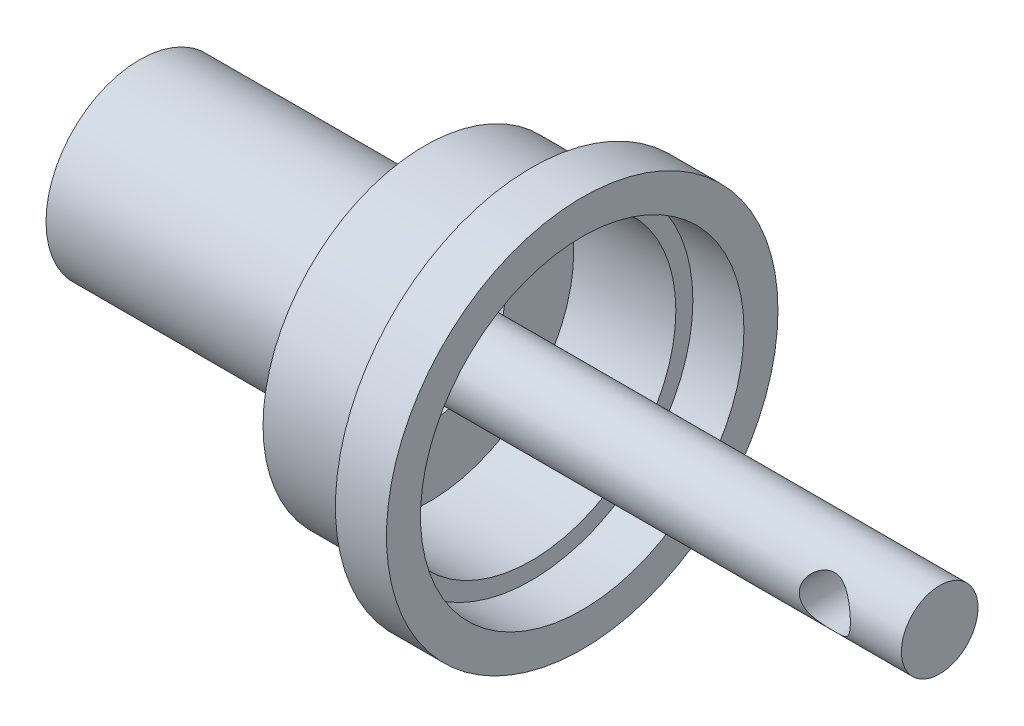
ISO-10303-21;
HEADER;
FILE_DESCRIPTION(('STEP AP214'),'2;1');
FILE_NAME('part.step','',(''),(''),'','','');
FILE_SCHEMA(('AUTOMOTIVE_DESIGN { 1 0 10303 214 1 1 1 1 }'));
ENDSEC;
DATA;
#1=APPLICATION_CONTEXT('core data for automotive mechanical design processes');
#2=APPLICATION_PROTOCOL_DEFINITION('international standard','automotive_design',2000,#1);
#3=PRODUCT_CONTEXT('',#1,'mechanical');
#4=PRODUCT('Part','Part','',(#3));
#5=PRODUCT_RELATED_PRODUCT_CATEGORY('part','',(#4));
#6=PRODUCT_DEFINITION_FORMATION('','',#4);
#7=PRODUCT_DEFINITION_CONTEXT('part definition',#1,'design');
#8=PRODUCT_DEFINITION('design','',#6,#7);
#9=PRODUCT_DEFINITION_SHAPE('','',#8);
#10=(LENGTH_UNIT() NAMED_UNIT(*) SI_UNIT(.MILLI.,.METRE.));
#11=(NAMED_UNIT(*) PLANE_ANGLE_UNIT() SI_UNIT($,.RADIAN.));
#12=(NAMED_UNIT(*) SI_UNIT($,.STERADIAN.) SOLID_ANGLE_UNIT());
#13=UNCERTAINTY_MEASURE_WITH_UNIT(LENGTH_MEASURE(1.E-05),#10,'distance_accuracy_value','');
#14=(GEOMETRIC_REPRESENTATION_CONTEXT(3) GLOBAL_UNCERTAINTY_ASSIGNED_CONTEXT((#13)) GLOBAL_UNIT_ASSIGNED_CONTEXT((#10,
#11,#12)) REPRESENTATION_CONTEXT('',''));
#15=CARTESIAN_POINT('',(0.,0.,0.));
#16=DIRECTION('',(0.,0.,1.));
#17=DIRECTION('',(1.,0.,0.));
#18=AXIS2_PLACEMENT_3D('',#15,#16,#17);
#19=CARTESIAN_POINT('',(26.,0.,0.));
#20=DIRECTION('',(1.,0.,0.));
#21=DIRECTION('',(0.,0.,-1.));
#22=AXIS2_PLACEMENT_3D('',#19,#20,#21);
#23=PLANE('',#22);
#24=CARTESIAN_POINT('',(26.,0.,0.));
#25=DIRECTION('',(1.,0.,0.));
#26=DIRECTION('',(0.,0.,-1.));
#27=AXIS2_PLACEMENT_3D('',#24,#25,#26);
#28=CIRCLE('',#27,11.5);
#29=CARTESIAN_POINT('',(26.,0.,-11.5));
#30=VERTEX_POINT('',#29);
#31=EDGE_CURVE('E12',#30,#30,#28,.T.);
#32=ORIENTED_EDGE('',*,*,#31,.T.);
#33=EDGE_LOOP('',(#32));
#34=FACE_BOUND('',#33,.T.);
#35=CARTESIAN_POINT('',(26.,0.,0.));
#36=DIRECTION('',(1.,0.,0.));
#37=DIRECTION('',(0.,0.,-1.));
#38=AXIS2_PLACEMENT_3D('',#35,#36,#37);
#39=CIRCLE('',#38,9.5);
#40=CARTESIAN_POINT('',(26.,0.,-9.5));
#41=VERTEX_POINT('',#40);
#42=EDGE_CURVE('E56',#41,#41,#39,.T.);
#43=ORIENTED_EDGE('',*,*,#42,.F.);
#44=EDGE_LOOP('',(#43));
#45=FACE_BOUND('',#44,.T.);
#46=ADVANCED_FACE('F45',(#34,#45),#23,.T.);
#47=CARTESIAN_POINT('',(23.,0.,0.));
#48=DIRECTION('',(1.,0.,0.));
#49=DIRECTION('',(0.,0.,-1.));
#50=AXIS2_PLACEMENT_3D('',#47,#48,#49);
#51=PLANE('',#50);
#52=CARTESIAN_POINT('',(23.,0.,0.));
#53=DIRECTION('',(1.,0.,0.));
#54=DIRECTION('',(0.,0.,-1.));
#55=AXIS2_PLACEMENT_3D('',#52,#53,#54);
#56=CIRCLE('',#55,11.5);
#57=CARTESIAN_POINT('',(23.,0.,-11.5));
#58=VERTEX_POINT('',#57);
#59=EDGE_CURVE('E49',#58,#58,#56,.T.);
#60=ORIENTED_EDGE('',*,*,#59,.F.);
#61=EDGE_LOOP('',(#60));
#62=FACE_BOUND('',#61,.T.);
#63=CARTESIAN_POINT('',(23.,0.,0.));
#64=DIRECTION('',(1.,0.,0.));
#65=DIRECTION('',(0.,0.,-1.));
#66=AXIS2_PLACEMENT_3D('',#63,#64,#65);
#67=CIRCLE('',#66,9.5);
#68=CARTESIAN_POINT('',(23.,0.,-9.5));
#69=VERTEX_POINT('',#68);
#70=EDGE_CURVE('E58',#69,#69,#67,.T.);
#71=ORIENTED_EDGE('',*,*,#70,.T.);
#72=EDGE_LOOP('',(#71));
#73=FACE_BOUND('',#72,.T.);
#74=ADVANCED_FACE('F68',(#62,#73),#51,.F.);
#75=CARTESIAN_POINT('',(26.,0.,0.));
#76=DIRECTION('',(-1.,0.,0.));
#77=DIRECTION('',(0.,0.,1.));
#78=AXIS2_PLACEMENT_3D('',#75,#76,#77);
#79=CYLINDRICAL_SURFACE('',#78,11.5);
#80=ORIENTED_EDGE('',*,*,#31,.F.);
#81=EDGE_LOOP('',(#80));
#82=FACE_BOUND('',#81,.T.);
#83=ORIENTED_EDGE('',*,*,#59,.T.);
#84=EDGE_LOOP('',(#83));
#85=FACE_BOUND('',#84,.T.);
#86=ADVANCED_FACE('F47',(#82,#85),#79,.T.);
#87=CARTESIAN_POINT('',(26.,0.,0.));
#88=DIRECTION('',(-1.,0.,0.));
#89=DIRECTION('',(0.,0.,1.));
#90=AXIS2_PLACEMENT_3D('',#87,#88,#89);
#91=CYLINDRICAL_SURFACE('',#90,9.5);
#92=ORIENTED_EDGE('',*,*,#42,.T.);
#93=EDGE_LOOP('',(#92));
#94=FACE_BOUND('',#93,.T.);
#95=ORIENTED_EDGE('',*,*,#70,.F.);
#96=EDGE_LOOP('',(#95));
#97=FACE_BOUND('',#96,.T.);
#98=ADVANCED_FACE('F64',(#94,#97),#91,.F.);
#99=CLOSED_SHELL('',(#46,#74,#86,#98));
#100=MANIFOLD_SOLID_BREP('B2',#99);
#101=CARTESIAN_POINT('',(17.,0.,0.));
#102=DIRECTION('',(-1.,0.,0.));
#103=DIRECTION('',(0.,0.,1.));
#104=AXIS2_PLACEMENT_3D('',#101,#102,#103);
#105=CYLINDRICAL_SURFACE('',#104,4.5);
#106=CARTESIAN_POINT('',(17.,0.,0.));
#107=DIRECTION('',(1.,0.,0.));
#108=DIRECTION('',(0.,0.,-1.));
#109=AXIS2_PLACEMENT_3D('',#106,#107,#108);
#110=CIRCLE('',#109,4.5);
#111=CARTESIAN_POINT('',(17.,0.,-4.5));
#112=VERTEX_POINT('',#111);
#113=EDGE_CURVE('E133',#112,#112,#110,.T.);
#114=ORIENTED_EDGE('',*,*,#113,.T.);
#115=EDGE_LOOP('',(#114));
#116=FACE_BOUND('',#115,.T.);
#117=CARTESIAN_POINT('',(5.,0.,0.));
#118=DIRECTION('',(1.,0.,0.));
#119=DIRECTION('',(0.,0.,-1.));
#120=AXIS2_PLACEMENT_3D('',#117,#118,#119);
#121=CIRCLE('',#120,4.5);
#122=CARTESIAN_POINT('',(5.,0.,-4.5));
#123=VERTEX_POINT('',#122);
#124=EDGE_CURVE('E120',#123,#123,#121,.F.);
#125=ORIENTED_EDGE('',*,*,#124,.T.);
#126=EDGE_LOOP('',(#125));
#127=FACE_BOUND('',#126,.T.);
#128=ADVANCED_FACE('F107',(#116,#127),#105,.F.);
#129=CARTESIAN_POINT('',(5.,0.,0.));
#130=DIRECTION('',(1.,0.,0.));
#131=DIRECTION('',(0.,0.,-1.));
#132=AXIS2_PLACEMENT_3D('',#129,#130,#131);
#133=PLANE('',#132);
#134=CARTESIAN_POINT('',(5.,0.,0.));
#135=DIRECTION('',(1.,0.,0.));
#136=DIRECTION('',(0.,0.,-1.));
#137=AXIS2_PLACEMENT_3D('',#134,#135,#136);
#138=CIRCLE('',#137,2.25);
#139=CARTESIAN_POINT('',(5.,0.,-2.25));
#140=VERTEX_POINT('',#139);
#141=EDGE_CURVE('E192',#140,#140,#138,.T.);
#142=ORIENTED_EDGE('',*,*,#141,.F.);
#143=EDGE_LOOP('',(#142));
#144=FACE_BOUND('',#143,.T.);
#145=ORIENTED_EDGE('',*,*,#124,.F.);
#146=EDGE_LOOP('',(#145));
#147=FACE_BOUND('',#146,.T.);
#148=ADVANCED_FACE('F167',(#144,#147),#133,.T.);
#149=CARTESIAN_POINT('',(47.,0.,0.));
#150=DIRECTION('',(-1.,0.,0.));
#151=DIRECTION('',(0.,0.,1.));
#152=AXIS2_PLACEMENT_3D('',#149,#150,#151);
#153=CYLINDRICAL_SURFACE('',#152,2.25);
#154=ORIENTED_EDGE('',*,*,#141,.T.);
#155=EDGE_LOOP('',(#154));
#156=FACE_BOUND('',#155,.T.);
#157=CARTESIAN_POINT('',(44.,0.,2.25));
#158=CARTESIAN_POINT('',(44.0000004122244,-0.0753635375010582,2.2500003123363));
#159=CARTESIAN_POINT('',(43.9942895225334,-0.150726815349676,2.24618102065041));
#160=CARTESIAN_POINT('',(43.9718023519208,-0.299049793523761,2.23128489317856));
#161=CARTESIAN_POINT('',(43.9550208176575,-0.372008335466256,2.22020461185926));
#162=CARTESIAN_POINT('',(43.9114192120064,-0.513159230890688,2.19187861803531));
#163=CARTESIAN_POINT('',(43.8846461449941,-0.581372154493168,2.17466179119986));
#164=CARTESIAN_POINT('',(43.8222024775464,-0.712061468247949,2.1354460340808));
#165=CARTESIAN_POINT('',(43.7865305852746,-0.774537023707255,2.11344640954132));
#166=CARTESIAN_POINT('',(43.7040072969744,-0.897963525577585,2.06420497027379));
#167=CARTESIAN_POINT('',(43.6564641044428,-0.95833522909551,2.03667673184489));
#168=CARTESIAN_POINT('',(43.5532024635062,-1.07079603351956,1.97986734812599));
#169=CARTESIAN_POINT('',(43.4974723026217,-1.12287304157916,1.95058372767623));
#170=CARTESIAN_POINT('',(43.3692107242905,-1.22566723309122,1.88796198509096));
#171=CARTESIAN_POINT('',(43.2954157600974,-1.27487389772064,1.85471300953349));
#172=CARTESIAN_POINT('',(43.1387274667651,-1.36012767760631,1.79313110514612));
#173=CARTESIAN_POINT('',(43.0558501988279,-1.39619755069875,1.7647897196599));
#174=CARTESIAN_POINT('',(42.9074665299338,-1.44505526258581,1.72482199981103));
#175=CARTESIAN_POINT('',(42.8438536603446,-1.46155835427013,1.71073220919326));
#176=CARTESIAN_POINT('',(42.7139416214437,-1.48612963338915,1.68943477244678));
#177=CARTESIAN_POINT('',(42.6476472884552,-1.4942123598895,1.68221526558019));
#178=CARTESIAN_POINT('',(42.5138939158579,-1.50143523105944,1.67577454206125));
#179=CARTESIAN_POINT('',(42.4464312324116,-1.50053882188231,1.67658601919217));
#180=CARTESIAN_POINT('',(42.3127737698743,-1.48978185999929,1.68614831612228));
#181=CARTESIAN_POINT('',(42.2465801134755,-1.47991371284968,1.69490586213888));
#182=CARTESIAN_POINT('',(42.1201497115718,-1.45248745663307,1.71845389493686));
#183=CARTESIAN_POINT('',(42.0597789980577,-1.4352878361075,1.7329611624773));
#184=CARTESIAN_POINT('',(41.9427322317564,-1.39402588936425,1.76632217195768));
#185=CARTESIAN_POINT('',(41.886057402277,-1.36996130492153,1.78517734374582));
#186=CARTESIAN_POINT('',(41.7657309535383,-1.31005364054748,1.82973147303318));
#187=CARTESIAN_POINT('',(41.7030050748589,-1.27281039246576,1.85604238386761));
#188=CARTESIAN_POINT('',(41.5839624537621,-1.19001720350479,1.91018653383725));
#189=CARTESIAN_POINT('',(41.5276537567443,-1.1444570175605,1.9380216205642));
#190=CARTESIAN_POINT('',(41.4105930907166,-1.03485873983956,1.99907507793144));
#191=CARTESIAN_POINT('',(41.3514994634664,-0.968954537106741,2.03216058532537));
#192=CARTESIAN_POINT('',(41.2451026291176,-0.826505999330705,2.09413575506785));
#193=CARTESIAN_POINT('',(41.1977883909484,-0.749971724512736,2.12302933237928));
#194=CARTESIAN_POINT('',(41.1248917110287,-0.60364337031839,2.16859053066249));
#195=CARTESIAN_POINT('',(41.0968674774947,-0.53546823252785,2.18654445873747));
#196=CARTESIAN_POINT('',(41.0509213057821,-0.394527032952668,2.21630789273282));
#197=CARTESIAN_POINT('',(41.0329908296511,-0.321764909251513,2.22812259095767));
#198=CARTESIAN_POINT('',(41.0081291260712,-0.173239089878911,2.24456911617496));
#199=CARTESIAN_POINT('',(41.0012454042962,-0.0974638589505289,2.24916991845861));
#200=CARTESIAN_POINT('',(40.9990646835784,0.054331139541946,2.25062336223889));
#201=CARTESIAN_POINT('',(41.0037668746334,0.130350889639962,2.24747654539233));
#202=CARTESIAN_POINT('',(41.0237180416715,0.274841787903212,2.23424692068197));
#203=CARTESIAN_POINT('',(41.0382029733164,0.343468083509414,2.22466684792667));
#204=CARTESIAN_POINT('',(41.0761967645097,0.47708729432056,2.19988836963629));
#205=CARTESIAN_POINT('',(41.0997070631962,0.542079628178361,2.18468906810242));
#206=CARTESIAN_POINT('',(41.1564892227837,0.670998562849511,2.14872264396867));
#207=CARTESIAN_POINT('',(41.1902661155614,0.734622138473577,2.12767402601838));
#208=CARTESIAN_POINT('',(41.2658249674597,0.855512267967981,2.08201391708632));
#209=CARTESIAN_POINT('',(41.3076118703991,0.912774861150694,2.05740022802955));
#210=CARTESIAN_POINT('',(41.4054559011181,1.02889084111744,2.00215909990072));
#211=CARTESIAN_POINT('',(41.4627246950563,1.08656390677175,1.97119617600123));
#212=CARTESIAN_POINT('',(41.5858335724679,1.19200476052088,1.90928379814467));
#213=CARTESIAN_POINT('',(41.6516795293306,1.23976570242923,1.87833436813383));
#214=CARTESIAN_POINT('',(41.7853568095761,1.32093582411986,1.82204759227934));
#215=CARTESIAN_POINT('',(41.8525490250967,1.35521727093963,1.79645697769275));
#216=CARTESIAN_POINT('',(41.9929044893327,1.41372160305199,1.75079230699615));
#217=CARTESIAN_POINT('',(42.0660567037285,1.43796259261643,1.73070834397366));
#218=CARTESIAN_POINT('',(42.2034233653966,1.47176882599005,1.70199906136974));
#219=CARTESIAN_POINT('',(42.266878857407,1.48318948174669,1.69196248515942));
#220=CARTESIAN_POINT('',(42.3954299609888,1.4977440444253,1.67909599828798));
#221=CARTESIAN_POINT('',(42.4605237133546,1.50088695213988,1.67625826010862));
#222=CARTESIAN_POINT('',(42.5904822925428,1.4986794148595,1.67823150862486));
#223=CARTESIAN_POINT('',(42.6553469610303,1.49332394075838,1.68304702430597));
#224=CARTESIAN_POINT('',(42.7830076463991,1.47447747918559,1.69957839302618));
#225=CARTESIAN_POINT('',(42.8458007853683,1.46097563796193,1.71130345145711));
#226=CARTESIAN_POINT('',(42.9842833898609,1.4219477674312,1.74395132928601));
#227=CARTESIAN_POINT('',(43.0589507847075,1.39417640348073,1.76649250181237));
#228=CARTESIAN_POINT('',(43.2016151257882,1.32813394677165,1.81666620840982));
#229=CARTESIAN_POINT('',(43.2696025234938,1.28984811255944,1.84430587265025));
#230=CARTESIAN_POINT('',(43.3994614153522,1.20298710416364,1.9021288993284));
#231=CARTESIAN_POINT('',(43.4611990590673,1.15423732420515,1.9323494054421));
#232=CARTESIAN_POINT('',(43.5764918586935,1.0475382602332,1.99221226153383));
#233=CARTESIAN_POINT('',(43.6300444977719,0.989586157693103,2.02185443124298));
#234=CARTESIAN_POINT('',(43.7350340782318,0.856092997327292,2.08223663973062));
#235=CARTESIAN_POINT('',(43.7850639801337,0.779221252166795,2.11252354087494));
#236=CARTESIAN_POINT('',(43.870934957499,0.615651416828395,2.16583249405621));
#237=CARTESIAN_POINT('',(43.906798330118,0.52896904683685,2.18886595083942));
#238=CARTESIAN_POINT('',(43.9558659336228,0.368576302376793,2.22076233627672));
#239=CARTESIAN_POINT('',(43.972333279324,0.296259243943428,2.23163610276701));
#240=CARTESIAN_POINT('',(43.9943960244036,0.149293509017953,2.2462521010639));
#241=CARTESIAN_POINT('',(43.999999591697,0.0746466271410026,2.24999969063486));
#242=CARTESIAN_POINT('',(44.,0.,2.25));
#243=B_SPLINE_CURVE_WITH_KNOTS('',3,(#157,#158,#159,#160,#161,#162,#163,#164,#165,#166,#167,
#168,#169,#170,#171,#172,#173,#174,#175,#176,#177,#178,#179,#180,#181,#182,#183,#184,#185,#186,
#187,#188,#189,#190,#191,#192,#193,#194,#195,#196,#197,#198,#199,#200,#201,#202,#203,#204,#205,
#206,#207,#208,#209,#210,#211,#212,#213,#214,#215,#216,#217,#218,#219,#220,#221,#222,#223,#224,
#225,#226,#227,#228,#229,#230,#231,#232,#233,#234,#235,#236,#237,#238,#239,#240,#241,#242),
.UNSPECIFIED.,.T.,.F.,(4,2,2,2,2,2,2,2,2,2,2,2,2,2,2,2,2,2,2,2,2,2,2,2,2,2,2,2,2,2,2,2,2,2,2,2,
2,2,2,2,2,2,4),(0.,0.225789919879049,0.451687060761517,0.676534614892679,0.901414829005404,
1.14537771750418,1.38969308703239,1.67255012471987,1.9549147908408,2.15575270257023,
2.35624325884358,2.55755033801536,2.75902797947516,2.95161646648519,3.14426837853811,
3.37610680994697,3.60823277833821,3.89039215871342,4.172286302248,4.39893065771347,
4.62538301355888,4.85280662469467,5.0802143364884,5.29164813593133,5.50311566352482,
5.72739260120916,5.95180841207682,6.21171132104748,6.47179314880597,6.70987451477136,
6.9475246997932,7.14243036010879,7.33712400248597,7.5319329021219,7.72700192888079,
7.97404956526924,8.22144535032245,8.47334433902143,8.72532062976394,9.01346513667902,
9.301154299194,9.52496468523838,9.74860673443454),.UNSPECIFIED.);
#244=CARTESIAN_POINT('',(44.,0.,2.25));
#245=VERTEX_POINT('',#244);
#246=EDGE_CURVE('E111',#245,#245,#243,.T.);
#247=ORIENTED_EDGE('',*,*,#246,.T.);
#248=EDGE_LOOP('',(#247));
#249=FACE_BOUND('',#248,.T.);
#250=CARTESIAN_POINT('',(44.,0.,-2.25));
#251=CARTESIAN_POINT('',(44.0000004122244,0.0753635375010587,-2.2500003123363));
#252=CARTESIAN_POINT('',(43.9942895225334,0.150726815349677,-2.24618102065041));
#253=CARTESIAN_POINT('',(43.9718023519208,0.299049793523762,-2.23128489317856));
#254=CARTESIAN_POINT('',(43.9550208176575,0.372008335466256,-2.22020461185926));
#255=CARTESIAN_POINT('',(43.9114192120064,0.513159230890688,-2.19187861803531));
#256=CARTESIAN_POINT('',(43.8846461449941,0.581372154493167,-2.17466179119986));
#257=CARTESIAN_POINT('',(43.8222024775464,0.712061468247947,-2.1354460340808));
#258=CARTESIAN_POINT('',(43.7865305852746,0.774537023707255,-2.11344640954132));
#259=CARTESIAN_POINT('',(43.7040072969744,0.897963525577586,-2.06420497027378));
#260=CARTESIAN_POINT('',(43.6564641044428,0.958335229095511,-2.03667673184489));
#261=CARTESIAN_POINT('',(43.5532024635062,1.07079603351956,-1.97986734812599));
#262=CARTESIAN_POINT('',(43.4974723026217,1.12287304157916,-1.95058372767623));
#263=CARTESIAN_POINT('',(43.3692107242905,1.22566723309122,-1.88796198509096));
#264=CARTESIAN_POINT('',(43.2954157600974,1.27487389772063,-1.85471300953349));
#265=CARTESIAN_POINT('',(43.1387274667651,1.36012767760631,-1.79313110514612));
#266=CARTESIAN_POINT('',(43.0558501988279,1.39619755069875,-1.7647897196599));
#267=CARTESIAN_POINT('',(42.9074665299338,1.44505526258581,-1.72482199981103));
#268=CARTESIAN_POINT('',(42.8438536603446,1.46155835427013,-1.71073220919326));
#269=CARTESIAN_POINT('',(42.7139416214437,1.48612963338916,-1.68943477244678));
#270=CARTESIAN_POINT('',(42.6476472884552,1.4942123598895,-1.68221526558019));
#271=CARTESIAN_POINT('',(42.5138939158579,1.50143523105944,-1.67577454206125));
#272=CARTESIAN_POINT('',(42.4464312324116,1.50053882188231,-1.67658601919217));
#273=CARTESIAN_POINT('',(42.3127737698743,1.48978185999929,-1.68614831612228));
#274=CARTESIAN_POINT('',(42.2465801134755,1.47991371284968,-1.69490586213887));
#275=CARTESIAN_POINT('',(42.1201497115718,1.45248745663307,-1.71845389493686));
#276=CARTESIAN_POINT('',(42.0597789980577,1.43528783610751,-1.73296116247729));
#277=CARTESIAN_POINT('',(41.9427322317564,1.39402588936425,-1.76632217195768));
#278=CARTESIAN_POINT('',(41.886057402277,1.36996130492153,-1.78517734374582));
#279=CARTESIAN_POINT('',(41.7657309535383,1.31005364054748,-1.82973147303318));
#280=CARTESIAN_POINT('',(41.7030050748589,1.27281039246576,-1.85604238386761));
#281=CARTESIAN_POINT('',(41.5839624537621,1.19001720350479,-1.91018653383725));
#282=CARTESIAN_POINT('',(41.5276537567443,1.1444570175605,-1.9380216205642));
#283=CARTESIAN_POINT('',(41.4105930907166,1.03485873983956,-1.99907507793143));
#284=CARTESIAN_POINT('',(41.3514994634664,0.968954537106742,-2.03216058532537));
#285=CARTESIAN_POINT('',(41.2451026291176,0.826505999330706,-2.09413575506785));
#286=CARTESIAN_POINT('',(41.1977883909484,0.749971724512737,-2.12302933237928));
#287=CARTESIAN_POINT('',(41.1248917110287,0.603643370318391,-2.16859053066249));
#288=CARTESIAN_POINT('',(41.0968674774947,0.535468232527851,-2.18654445873747));
#289=CARTESIAN_POINT('',(41.0509213057821,0.394527032952669,-2.21630789273282));
#290=CARTESIAN_POINT('',(41.0329908296511,0.321764909251514,-2.22812259095767));
#291=CARTESIAN_POINT('',(41.0081291260712,0.173239089878912,-2.24456911617496));
#292=CARTESIAN_POINT('',(41.0012454042962,0.0974638589505304,-2.24916991845861));
#293=CARTESIAN_POINT('',(40.9990646835784,-0.0543311395419446,-2.25062336223889));
#294=CARTESIAN_POINT('',(41.0037668746334,-0.130350889639961,-2.24747654539233));
#295=CARTESIAN_POINT('',(41.0237180416715,-0.27484178790321,-2.23424692068197));
#296=CARTESIAN_POINT('',(41.0382029733164,-0.343468083509413,-2.22466684792667));
#297=CARTESIAN_POINT('',(41.0761967645097,-0.477087294320558,-2.19988836963629));
#298=CARTESIAN_POINT('',(41.0997070631962,-0.54207962817836,-2.18468906810242));
#299=CARTESIAN_POINT('',(41.1564892227837,-0.67099856284951,-2.14872264396867));
#300=CARTESIAN_POINT('',(41.1902661155614,-0.734622138473576,-2.12767402601838));
#301=CARTESIAN_POINT('',(41.2658249674597,-0.85551226796798,-2.08201391708632));
#302=CARTESIAN_POINT('',(41.3076118703991,-0.912774861150693,-2.05740022802955));
#303=CARTESIAN_POINT('',(41.4054559011181,-1.02889084111744,-2.00215909990072));
#304=CARTESIAN_POINT('',(41.4627246950563,-1.08656390677175,-1.97119617600123));
#305=CARTESIAN_POINT('',(41.5858335724679,-1.19200476052088,-1.90928379814468));
#306=CARTESIAN_POINT('',(41.6516795293306,-1.23976570242923,-1.87833436813383));
#307=CARTESIAN_POINT('',(41.7853568095761,-1.32093582411986,-1.82204759227934));
#308=CARTESIAN_POINT('',(41.8525490250967,-1.35521727093963,-1.79645697769275));
#309=CARTESIAN_POINT('',(41.9929044893327,-1.41372160305199,-1.75079230699615));
#310=CARTESIAN_POINT('',(42.0660567037285,-1.43796259261642,-1.73070834397366));
#311=CARTESIAN_POINT('',(42.2034233653966,-1.47176882599005,-1.70199906136974));
#312=CARTESIAN_POINT('',(42.266878857407,-1.48318948174669,-1.69196248515942));
#313=CARTESIAN_POINT('',(42.3954299609888,-1.4977440444253,-1.67909599828798));
#314=CARTESIAN_POINT('',(42.4605237133546,-1.50088695213988,-1.67625826010862));
#315=CARTESIAN_POINT('',(42.5904822925428,-1.4986794148595,-1.67823150862486));
#316=CARTESIAN_POINT('',(42.6553469610303,-1.49332394075838,-1.68304702430597));
#317=CARTESIAN_POINT('',(42.7830076463991,-1.4744774791856,-1.69957839302618));
#318=CARTESIAN_POINT('',(42.8458007853683,-1.46097563796193,-1.71130345145711));
#319=CARTESIAN_POINT('',(42.9842833898609,-1.4219477674312,-1.743951329286));
#320=CARTESIAN_POINT('',(43.0589507847075,-1.39417640348073,-1.76649250181237));
#321=CARTESIAN_POINT('',(43.2016151257882,-1.32813394677165,-1.81666620840982));
#322=CARTESIAN_POINT('',(43.2696025234938,-1.28984811255944,-1.84430587265025));
#323=CARTESIAN_POINT('',(43.3994614153522,-1.20298710416364,-1.90212889932839));
#324=CARTESIAN_POINT('',(43.4611990590673,-1.15423732420515,-1.9323494054421));
#325=CARTESIAN_POINT('',(43.5764918586935,-1.04753826023321,-1.99221226153383));
#326=CARTESIAN_POINT('',(43.6300444977719,-0.989586157693111,-2.02185443124297));
#327=CARTESIAN_POINT('',(43.7350340782318,-0.8560929973273,-2.08223663973062));
#328=CARTESIAN_POINT('',(43.7850639801337,-0.779221252166802,-2.11252354087494));
#329=CARTESIAN_POINT('',(43.870934957499,-0.615651416828405,-2.16583249405621));
#330=CARTESIAN_POINT('',(43.906798330118,-0.528969046836862,-2.18886595083941));
#331=CARTESIAN_POINT('',(43.9558659336228,-0.368576302376806,-2.22076233627672));
#332=CARTESIAN_POINT('',(43.972333279324,-0.296259243943438,-2.23163610276701));
#333=CARTESIAN_POINT('',(43.9943960244036,-0.149293509017957,-2.2462521010639));
#334=CARTESIAN_POINT('',(43.999999591697,-0.0746466271410046,-2.24999969063486));
#335=CARTESIAN_POINT('',(44.,0.,-2.25));
#336=B_SPLINE_CURVE_WITH_KNOTS('',3,(#250,#251,#252,#253,#254,#255,#256,#257,#258,#259,#260,
#261,#262,#263,#264,#265,#266,#267,#268,#269,#270,#271,#272,#273,#274,#275,#276,#277,#278,#279,
#280,#281,#282,#283,#284,#285,#286,#287,#288,#289,#290,#291,#292,#293,#294,#295,#296,#297,#298,
#299,#300,#301,#302,#303,#304,#305,#306,#307,#308,#309,#310,#311,#312,#313,#314,#315,#316,#317,
#318,#319,#320,#321,#322,#323,#324,#325,#326,#327,#328,#329,#330,#331,#332,#333,#334,#335),
.UNSPECIFIED.,.T.,.F.,(4,2,2,2,2,2,2,2,2,2,2,2,2,2,2,2,2,2,2,2,2,2,2,2,2,2,2,2,2,2,2,2,2,2,2,2,
2,2,2,2,2,2,4),(0.,0.225789919879049,0.451687060761517,0.676534614892677,0.901414829005404,
1.14537771750418,1.38969308703239,1.67255012471986,1.9549147908408,2.15575270257023,
2.35624325884358,2.55755033801536,2.75902797947516,2.95161646648519,3.14426837853811,
3.37610680994697,3.60823277833821,3.89039215871342,4.172286302248,4.39893065771347,
4.62538301355888,4.85280662469467,5.0802143364884,5.29164813593133,5.50311566352481,
5.72739260120916,5.95180841207682,6.21171132104748,6.47179314880597,6.70987451477136,
6.9475246997932,7.14243036010879,7.33712400248597,7.53193290212188,7.72700192888078,
7.97404956526923,8.22144535032243,8.47334433902141,8.72532062976392,9.013465136679,
9.30115429919398,9.52496468523837,9.74860673443454),.UNSPECIFIED.);
#337=CARTESIAN_POINT('',(44.,0.,-2.25));
#338=VERTEX_POINT('',#337);
#339=EDGE_CURVE('E128',#338,#338,#336,.T.);
#340=ORIENTED_EDGE('',*,*,#339,.T.);
#341=EDGE_LOOP('',(#340));
#342=FACE_BOUND('',#341,.T.);
#343=CARTESIAN_POINT('',(47.,0.,0.));
#344=DIRECTION('',(1.,0.,0.));
#345=DIRECTION('',(0.,0.,-1.));
#346=AXIS2_PLACEMENT_3D('',#343,#344,#345);
#347=CIRCLE('',#346,2.25);
#348=CARTESIAN_POINT('',(47.,0.,-2.25));
#349=VERTEX_POINT('',#348);
#350=EDGE_CURVE('E191',#349,#349,#347,.T.);
#351=ORIENTED_EDGE('',*,*,#350,.F.);
#352=EDGE_LOOP('',(#351));
#353=FACE_BOUND('',#352,.T.);
#354=ADVANCED_FACE('F134',(#156,#249,#342,#353),#153,.T.);
#355=CARTESIAN_POINT('',(47.,0.,0.));
#356=DIRECTION('',(1.,0.,0.));
#357=DIRECTION('',(0.,0.,-1.));
#358=AXIS2_PLACEMENT_3D('',#355,#356,#357);
#359=PLANE('',#358);
#360=ORIENTED_EDGE('',*,*,#350,.T.);
#361=EDGE_LOOP('',(#360));
#362=FACE_BOUND('',#361,.T.);
#363=ADVANCED_FACE('F142',(#362),#359,.T.);
#364=CARTESIAN_POINT('',(42.5,0.,-11.5));
#365=DIRECTION('',(0.,0.,1.));
#366=DIRECTION('',(1.,0.,0.));
#367=AXIS2_PLACEMENT_3D('',#364,#365,#366);
#368=CYLINDRICAL_SURFACE('',#367,1.5);
#369=ORIENTED_EDGE('',*,*,#339,.F.);
#370=EDGE_LOOP('',(#369));
#371=FACE_BOUND('',#370,.T.);
#372=ORIENTED_EDGE('',*,*,#246,.F.);
#373=EDGE_LOOP('',(#372));
#374=FACE_BOUND('',#373,.T.);
#375=ADVANCED_FACE('F138',(#371,#374),#368,.F.);
#376=CARTESIAN_POINT('',(5.,0.,0.));
#377=DIRECTION('',(-1.,0.,0.));
#378=DIRECTION('',(0.,0.,1.));
#379=AXIS2_PLACEMENT_3D('',#376,#377,#378);
#380=CYLINDRICAL_SURFACE('',#379,5.5);
#381=CARTESIAN_POINT('',(16.75,0.,0.));
#382=DIRECTION('',(-1.,0.,0.));
#383=DIRECTION('',(0.,0.,1.));
#384=AXIS2_PLACEMENT_3D('',#381,#382,#383);
#385=CIRCLE('',#384,5.5);
#386=CARTESIAN_POINT('',(16.75,0.,5.5));
#387=VERTEX_POINT('',#386);
#388=EDGE_CURVE('E196',#387,#387,#385,.T.);
#389=ORIENTED_EDGE('',*,*,#388,.T.);
#390=EDGE_LOOP('',(#389));
#391=FACE_BOUND('',#390,.T.);
#392=CARTESIAN_POINT('',(0.,0.,0.));
#393=DIRECTION('',(1.,0.,0.));
#394=DIRECTION('',(0.,0.,-1.));
#395=AXIS2_PLACEMENT_3D('',#392,#393,#394);
#396=CIRCLE('',#395,5.5);
#397=CARTESIAN_POINT('',(0.,0.,-5.5));
#398=VERTEX_POINT('',#397);
#399=EDGE_CURVE('E125',#398,#398,#396,.T.);
#400=ORIENTED_EDGE('',*,*,#399,.T.);
#401=EDGE_LOOP('',(#400));
#402=FACE_BOUND('',#401,.T.);
#403=ADVANCED_FACE('F109',(#391,#402),#380,.T.);
#404=CARTESIAN_POINT('',(0.,0.,0.));
#405=DIRECTION('',(1.,0.,0.));
#406=DIRECTION('',(0.,0.,-1.));
#407=AXIS2_PLACEMENT_3D('',#404,#405,#406);
#408=PLANE('',#407);
#409=ORIENTED_EDGE('',*,*,#399,.F.);
#410=EDGE_LOOP('',(#409));
#411=FACE_BOUND('',#410,.T.);
#412=ADVANCED_FACE('F160',(#411),#408,.F.);
#413=CARTESIAN_POINT('',(16.75,0.,0.));
#414=DIRECTION('',(1.,0.,0.));
#415=DIRECTION('',(0.,0.,-1.));
#416=AXIS2_PLACEMENT_3D('',#413,#414,#415);
#417=CYLINDRICAL_SURFACE('',#416,9.5);
#418=CARTESIAN_POINT('',(16.75,0.,0.));
#419=DIRECTION('',(-1.,0.,0.));
#420=DIRECTION('',(0.,0.,1.));
#421=AXIS2_PLACEMENT_3D('',#418,#419,#420);
#422=CIRCLE('',#421,9.5);
#423=CARTESIAN_POINT('',(16.75,0.,9.5));
#424=VERTEX_POINT('',#423);
#425=EDGE_CURVE('E200',#424,#424,#422,.T.);
#426=ORIENTED_EDGE('',*,*,#425,.F.);
#427=EDGE_LOOP('',(#426));
#428=FACE_BOUND('',#427,.T.);
#429=CARTESIAN_POINT('',(23.,0.,0.));
#430=DIRECTION('',(1.,0.,0.));
#431=DIRECTION('',(0.,0.,-1.));
#432=AXIS2_PLACEMENT_3D('',#429,#430,#431);
#433=CIRCLE('',#432,9.5);
#434=CARTESIAN_POINT('',(23.,0.,-9.5));
#435=VERTEX_POINT('',#434);
#436=EDGE_CURVE('E203',#435,#435,#433,.T.);
#437=ORIENTED_EDGE('',*,*,#436,.F.);
#438=EDGE_LOOP('',(#437));
#439=FACE_BOUND('',#438,.T.);
#440=ADVANCED_FACE('F157',(#428,#439),#417,.T.);
#441=CARTESIAN_POINT('',(16.75,0.,0.));
#442=DIRECTION('',(-1.,0.,0.));
#443=DIRECTION('',(0.,0.,1.));
#444=AXIS2_PLACEMENT_3D('',#441,#442,#443);
#445=PLANE('',#444);
#446=ORIENTED_EDGE('',*,*,#388,.F.);
#447=EDGE_LOOP('',(#446));
#448=FACE_BOUND('',#447,.T.);
#449=ORIENTED_EDGE('',*,*,#425,.T.);
#450=EDGE_LOOP('',(#449));
#451=FACE_BOUND('',#450,.T.);
#452=ADVANCED_FACE('F153',(#448,#451),#445,.T.);
#453=CARTESIAN_POINT('',(23.,0.,0.));
#454=DIRECTION('',(1.,0.,0.));
#455=DIRECTION('',(0.,0.,-1.));
#456=AXIS2_PLACEMENT_3D('',#453,#454,#455);
#457=PLANE('',#456);
#458=ORIENTED_EDGE('',*,*,#436,.T.);
#459=EDGE_LOOP('',(#458));
#460=FACE_BOUND('',#459,.T.);
#461=CARTESIAN_POINT('',(23.,0.,0.));
#462=DIRECTION('',(1.,0.,0.));
#463=DIRECTION('',(0.,0.,-1.));
#464=AXIS2_PLACEMENT_3D('',#461,#462,#463);
#465=CIRCLE('',#464,8.5);
#466=CARTESIAN_POINT('',(23.,0.,-8.5));
#467=VERTEX_POINT('',#466);
#468=EDGE_CURVE('E206',#467,#467,#465,.T.);
#469=ORIENTED_EDGE('',*,*,#468,.F.);
#470=EDGE_LOOP('',(#469));
#471=FACE_BOUND('',#470,.T.);
#472=ADVANCED_FACE('F149',(#460,#471),#457,.T.);
#473=CARTESIAN_POINT('',(23.,0.,0.));
#474=DIRECTION('',(-1.,0.,0.));
#475=DIRECTION('',(0.,0.,1.));
#476=AXIS2_PLACEMENT_3D('',#473,#474,#475);
#477=CYLINDRICAL_SURFACE('',#476,8.5);
#478=ORIENTED_EDGE('',*,*,#468,.T.);
#479=EDGE_LOOP('',(#478));
#480=FACE_BOUND('',#479,.T.);
#481=CARTESIAN_POINT('',(17.,0.,0.));
#482=DIRECTION('',(1.,0.,0.));
#483=DIRECTION('',(0.,0.,-1.));
#484=AXIS2_PLACEMENT_3D('',#481,#482,#483);
#485=CIRCLE('',#484,8.5);
#486=CARTESIAN_POINT('',(17.,0.,-8.5));
#487=VERTEX_POINT('',#486);
#488=EDGE_CURVE('E44',#487,#487,#485,.F.);
#489=ORIENTED_EDGE('',*,*,#488,.T.);
#490=EDGE_LOOP('',(#489));
#491=FACE_BOUND('',#490,.T.);
#492=ADVANCED_FACE('F144',(#480,#491),#477,.F.);
#493=CARTESIAN_POINT('',(17.,0.,0.));
#494=DIRECTION('',(1.,0.,0.));
#495=DIRECTION('',(0.,0.,-1.));
#496=AXIS2_PLACEMENT_3D('',#493,#494,#495);
#497=PLANE('',#496);
#498=ORIENTED_EDGE('',*,*,#113,.F.);
#499=EDGE_LOOP('',(#498));
#500=FACE_BOUND('',#499,.T.);
#501=ORIENTED_EDGE('',*,*,#488,.F.);
#502=EDGE_LOOP('',(#501));
#503=FACE_BOUND('',#502,.T.);
#504=ADVANCED_FACE('F148',(#500,#503),#497,.T.);
#505=CLOSED_SHELL('',(#128,#148,#354,#363,#375,#403,#412,#440,#452,#472,#492,#504));
#506=MANIFOLD_SOLID_BREP('B7',#505);
#507=ADVANCED_BREP_SHAPE_REPRESENTATION('',(#18,#100,#506),#14);
#508=SHAPE_DEFINITION_REPRESENTATION(#9,#507);
ENDSEC;
END-ISO-10303-21;
